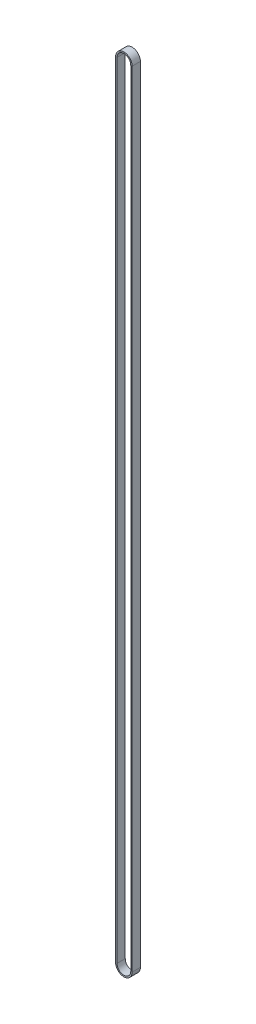
ISO-10303-21;
HEADER;
FILE_DESCRIPTION(('STEP AP214'),'2;1');
FILE_NAME('part.step','',(''),(''),'','','');
FILE_SCHEMA(('AUTOMOTIVE_DESIGN { 1 0 10303 214 1 1 1 1 }'));
ENDSEC;
DATA;
#1=APPLICATION_CONTEXT('core data for automotive mechanical design processes');
#2=APPLICATION_PROTOCOL_DEFINITION('international standard','automotive_design',2000,#1);
#3=PRODUCT_CONTEXT('',#1,'mechanical');
#4=PRODUCT('Part','Part','',(#3));
#5=PRODUCT_RELATED_PRODUCT_CATEGORY('part','',(#4));
#6=PRODUCT_DEFINITION_FORMATION('','',#4);
#7=PRODUCT_DEFINITION_CONTEXT('part definition',#1,'design');
#8=PRODUCT_DEFINITION('design','',#6,#7);
#9=PRODUCT_DEFINITION_SHAPE('','',#8);
#10=(LENGTH_UNIT() NAMED_UNIT(*) SI_UNIT(.MILLI.,.METRE.));
#11=(NAMED_UNIT(*) PLANE_ANGLE_UNIT() SI_UNIT($,.RADIAN.));
#12=(NAMED_UNIT(*) SI_UNIT($,.STERADIAN.) SOLID_ANGLE_UNIT());
#13=UNCERTAINTY_MEASURE_WITH_UNIT(LENGTH_MEASURE(1.E-05),#10,'distance_accuracy_value','');
#14=(GEOMETRIC_REPRESENTATION_CONTEXT(3) GLOBAL_UNCERTAINTY_ASSIGNED_CONTEXT((#13)) GLOBAL_UNIT_ASSIGNED_CONTEXT((#10,
#11,#12)) REPRESENTATION_CONTEXT('',''));
#15=CARTESIAN_POINT('',(0.,0.,0.));
#16=DIRECTION('',(0.,0.,1.));
#17=DIRECTION('',(1.,0.,0.));
#18=AXIS2_PLACEMENT_3D('',#15,#16,#17);
#19=CARTESIAN_POINT('',(0.,569.99997537,6.));
#20=DIRECTION('',(0.,0.,1.));
#21=DIRECTION('',(1.,0.,0.));
#22=AXIS2_PLACEMENT_3D('',#19,#20,#21);
#23=PLANE('',#22);
#24=CARTESIAN_POINT('',(0.,569.99997537,6.));
#25=DIRECTION('',(0.,0.,1.));
#26=DIRECTION('',(1.,0.,0.));
#27=AXIS2_PLACEMENT_3D('',#24,#25,#26);
#28=CIRCLE('',#27,6.);
#29=CARTESIAN_POINT('',(5.99999999999993,569.99997537,6.));
#30=VERTEX_POINT('',#29);
#31=CARTESIAN_POINT('',(-6.00000000000007,569.99997537,6.));
#32=VERTEX_POINT('',#31);
#33=EDGE_CURVE('E139',#30,#32,#28,.T.);
#34=ORIENTED_EDGE('',*,*,#33,.T.);
#35=DIRECTION('',(0.,-1.,0.));
#36=VECTOR('',#35,1.);
#37=CARTESIAN_POINT('',(-6.00000000000007,569.99997537,6.));
#38=LINE('',#37,#36);
#39=CARTESIAN_POINT('',(-6.,0.,6.));
#40=VERTEX_POINT('',#39);
#41=EDGE_CURVE('E142',#32,#40,#38,.T.);
#42=ORIENTED_EDGE('',*,*,#41,.T.);
#43=CARTESIAN_POINT('',(0.,0.,6.));
#44=DIRECTION('',(0.,0.,1.));
#45=DIRECTION('',(1.,0.,0.));
#46=AXIS2_PLACEMENT_3D('',#43,#44,#45);
#47=CIRCLE('',#46,6.);
#48=CARTESIAN_POINT('',(6.,0.,6.));
#49=VERTEX_POINT('',#48);
#50=EDGE_CURVE('E145',#40,#49,#47,.T.);
#51=ORIENTED_EDGE('',*,*,#50,.T.);
#52=DIRECTION('',(0.,1.,0.));
#53=VECTOR('',#52,1.);
#54=CARTESIAN_POINT('',(6.,0.,6.));
#55=LINE('',#54,#53);
#56=EDGE_CURVE('E147',#49,#30,#55,.T.);
#57=ORIENTED_EDGE('',*,*,#56,.T.);
#58=EDGE_LOOP('',(#34,#42,#51,#57));
#59=FACE_BOUND('',#58,.T.);
#60=DIRECTION('',(0.,-1.,0.));
#61=VECTOR('',#60,1.);
#62=CARTESIAN_POINT('',(-5.00000000000007,569.99997537,6.));
#63=LINE('',#62,#61);
#64=CARTESIAN_POINT('',(-5.00000000000007,569.99997537,6.));
#65=VERTEX_POINT('',#64);
#66=CARTESIAN_POINT('',(-5.,0.,6.));
#67=VERTEX_POINT('',#66);
#68=EDGE_CURVE('E110',#65,#67,#63,.T.);
#69=ORIENTED_EDGE('',*,*,#68,.F.);
#70=CARTESIAN_POINT('',(0.,569.99997537,6.));
#71=DIRECTION('',(0.,0.,1.));
#72=DIRECTION('',(1.,0.,0.));
#73=AXIS2_PLACEMENT_3D('',#70,#71,#72);
#74=CIRCLE('',#73,5.);
#75=CARTESIAN_POINT('',(4.99999999999993,569.99997537,6.));
#76=VERTEX_POINT('',#75);
#77=EDGE_CURVE('E102',#76,#65,#74,.T.);
#78=ORIENTED_EDGE('',*,*,#77,.F.);
#79=DIRECTION('',(0.,1.,0.));
#80=VECTOR('',#79,1.);
#81=CARTESIAN_POINT('',(5.,0.,6.));
#82=LINE('',#81,#80);
#83=CARTESIAN_POINT('',(5.,0.,6.));
#84=VERTEX_POINT('',#83);
#85=EDGE_CURVE('E124',#84,#76,#82,.T.);
#86=ORIENTED_EDGE('',*,*,#85,.F.);
#87=CARTESIAN_POINT('',(0.,0.,6.));
#88=DIRECTION('',(0.,0.,1.));
#89=DIRECTION('',(1.,0.,0.));
#90=AXIS2_PLACEMENT_3D('',#87,#88,#89);
#91=CIRCLE('',#90,5.);
#92=EDGE_CURVE('E122',#67,#84,#91,.T.);
#93=ORIENTED_EDGE('',*,*,#92,.F.);
#94=EDGE_LOOP('',(#69,#78,#86,#93));
#95=FACE_BOUND('',#94,.T.);
#96=ADVANCED_FACE('F37',(#59,#95),#23,.T.);
#97=CARTESIAN_POINT('',(0.,569.99997537,0.));
#98=DIRECTION('',(0.,0.,1.));
#99=DIRECTION('',(1.,0.,0.));
#100=AXIS2_PLACEMENT_3D('',#97,#98,#99);
#101=PLANE('',#100);
#102=CARTESIAN_POINT('',(0.,569.99997537,0.));
#103=DIRECTION('',(0.,0.,1.));
#104=DIRECTION('',(1.,0.,0.));
#105=AXIS2_PLACEMENT_3D('',#102,#103,#104);
#106=CIRCLE('',#105,6.);
#107=CARTESIAN_POINT('',(5.99999999999993,569.99997537,0.));
#108=VERTEX_POINT('',#107);
#109=CARTESIAN_POINT('',(-6.00000000000007,569.99997537,0.));
#110=VERTEX_POINT('',#109);
#111=EDGE_CURVE('E118',#108,#110,#106,.T.);
#112=ORIENTED_EDGE('',*,*,#111,.F.);
#113=DIRECTION('',(0.,1.,0.));
#114=VECTOR('',#113,1.);
#115=CARTESIAN_POINT('',(6.,0.,0.));
#116=LINE('',#115,#114);
#117=CARTESIAN_POINT('',(6.,0.,0.));
#118=VERTEX_POINT('',#117);
#119=EDGE_CURVE('E143',#118,#108,#116,.T.);
#120=ORIENTED_EDGE('',*,*,#119,.F.);
#121=CARTESIAN_POINT('',(0.,0.,0.));
#122=DIRECTION('',(0.,0.,1.));
#123=DIRECTION('',(1.,0.,0.));
#124=AXIS2_PLACEMENT_3D('',#121,#122,#123);
#125=CIRCLE('',#124,6.);
#126=CARTESIAN_POINT('',(-6.,0.,0.));
#127=VERTEX_POINT('',#126);
#128=EDGE_CURVE('E155',#127,#118,#125,.T.);
#129=ORIENTED_EDGE('',*,*,#128,.F.);
#130=DIRECTION('',(0.,-1.,0.));
#131=VECTOR('',#130,1.);
#132=CARTESIAN_POINT('',(-6.00000000000007,569.99997537,0.));
#133=LINE('',#132,#131);
#134=EDGE_CURVE('E153',#110,#127,#133,.T.);
#135=ORIENTED_EDGE('',*,*,#134,.F.);
#136=EDGE_LOOP('',(#112,#120,#129,#135));
#137=FACE_BOUND('',#136,.T.);
#138=CARTESIAN_POINT('',(0.,569.99997537,0.));
#139=DIRECTION('',(0.,0.,1.));
#140=DIRECTION('',(1.,0.,0.));
#141=AXIS2_PLACEMENT_3D('',#138,#139,#140);
#142=CIRCLE('',#141,5.);
#143=CARTESIAN_POINT('',(4.99999999999993,569.99997537,0.));
#144=VERTEX_POINT('',#143);
#145=CARTESIAN_POINT('',(-5.00000000000007,569.99997537,0.));
#146=VERTEX_POINT('',#145);
#147=EDGE_CURVE('E60',#144,#146,#142,.T.);
#148=ORIENTED_EDGE('',*,*,#147,.T.);
#149=DIRECTION('',(0.,-1.,0.));
#150=VECTOR('',#149,1.);
#151=CARTESIAN_POINT('',(-5.00000000000007,569.99997537,0.));
#152=LINE('',#151,#150);
#153=CARTESIAN_POINT('',(-5.,0.,0.));
#154=VERTEX_POINT('',#153);
#155=EDGE_CURVE('E117',#146,#154,#152,.T.);
#156=ORIENTED_EDGE('',*,*,#155,.T.);
#157=CARTESIAN_POINT('',(0.,0.,0.));
#158=DIRECTION('',(0.,0.,1.));
#159=DIRECTION('',(1.,0.,0.));
#160=AXIS2_PLACEMENT_3D('',#157,#158,#159);
#161=CIRCLE('',#160,5.);
#162=CARTESIAN_POINT('',(5.,0.,0.));
#163=VERTEX_POINT('',#162);
#164=EDGE_CURVE('E131',#154,#163,#161,.T.);
#165=ORIENTED_EDGE('',*,*,#164,.T.);
#166=DIRECTION('',(0.,1.,0.));
#167=VECTOR('',#166,1.);
#168=CARTESIAN_POINT('',(5.,0.,0.));
#169=LINE('',#168,#167);
#170=EDGE_CURVE('E111',#163,#144,#169,.T.);
#171=ORIENTED_EDGE('',*,*,#170,.T.);
#172=EDGE_LOOP('',(#148,#156,#165,#171));
#173=FACE_BOUND('',#172,.T.);
#174=ADVANCED_FACE('F174',(#137,#173),#101,.F.);
#175=CARTESIAN_POINT('',(0.,569.99997537,6.));
#176=DIRECTION('',(0.,0.,-1.));
#177=DIRECTION('',(-1.,0.,0.));
#178=AXIS2_PLACEMENT_3D('',#175,#176,#177);
#179=CYLINDRICAL_SURFACE('',#178,6.);
#180=ORIENTED_EDGE('',*,*,#111,.T.);
#181=DIRECTION('',(0.,0.,-1.));
#182=VECTOR('',#181,1.);
#183=CARTESIAN_POINT('',(-6.00000000000007,569.99997537,6.));
#184=LINE('',#183,#182);
#185=EDGE_CURVE('E11',#32,#110,#184,.T.);
#186=ORIENTED_EDGE('',*,*,#185,.F.);
#187=ORIENTED_EDGE('',*,*,#33,.F.);
#188=DIRECTION('',(0.,0.,-1.));
#189=VECTOR('',#188,1.);
#190=CARTESIAN_POINT('',(5.99999999999993,569.99997537,6.));
#191=LINE('',#190,#189);
#192=EDGE_CURVE('E150',#30,#108,#191,.T.);
#193=ORIENTED_EDGE('',*,*,#192,.T.);
#194=EDGE_LOOP('',(#180,#186,#187,#193));
#195=FACE_BOUND('',#194,.T.);
#196=ADVANCED_FACE('F39',(#195),#179,.T.);
#197=CARTESIAN_POINT('',(-6.00000000000007,569.99997537,6.));
#198=DIRECTION('',(1.,0.,0.));
#199=DIRECTION('',(0.,1.,0.));
#200=AXIS2_PLACEMENT_3D('',#197,#198,#199);
#201=PLANE('',#200);
#202=ORIENTED_EDGE('',*,*,#134,.T.);
#203=DIRECTION('',(0.,0.,-1.));
#204=VECTOR('',#203,1.);
#205=CARTESIAN_POINT('',(-6.,0.,6.));
#206=LINE('',#205,#204);
#207=EDGE_CURVE('E45',#40,#127,#206,.T.);
#208=ORIENTED_EDGE('',*,*,#207,.F.);
#209=ORIENTED_EDGE('',*,*,#41,.F.);
#210=ORIENTED_EDGE('',*,*,#185,.T.);
#211=EDGE_LOOP('',(#202,#208,#209,#210));
#212=FACE_BOUND('',#211,.T.);
#213=ADVANCED_FACE('F184',(#212),#201,.F.);
#214=CARTESIAN_POINT('',(0.,0.,6.));
#215=DIRECTION('',(0.,0.,-1.));
#216=DIRECTION('',(-1.,0.,0.));
#217=AXIS2_PLACEMENT_3D('',#214,#215,#216);
#218=CYLINDRICAL_SURFACE('',#217,6.);
#219=ORIENTED_EDGE('',*,*,#128,.T.);
#220=DIRECTION('',(0.,0.,-1.));
#221=VECTOR('',#220,1.);
#222=CARTESIAN_POINT('',(6.,0.,6.));
#223=LINE('',#222,#221);
#224=EDGE_CURVE('E161',#49,#118,#223,.T.);
#225=ORIENTED_EDGE('',*,*,#224,.F.);
#226=ORIENTED_EDGE('',*,*,#50,.F.);
#227=ORIENTED_EDGE('',*,*,#207,.T.);
#228=EDGE_LOOP('',(#219,#225,#226,#227));
#229=FACE_BOUND('',#228,.T.);
#230=ADVANCED_FACE('F168',(#229),#218,.T.);
#231=CARTESIAN_POINT('',(6.,0.,6.));
#232=DIRECTION('',(-1.,0.,0.));
#233=DIRECTION('',(0.,-1.,0.));
#234=AXIS2_PLACEMENT_3D('',#231,#232,#233);
#235=PLANE('',#234);
#236=ORIENTED_EDGE('',*,*,#119,.T.);
#237=ORIENTED_EDGE('',*,*,#192,.F.);
#238=ORIENTED_EDGE('',*,*,#56,.F.);
#239=ORIENTED_EDGE('',*,*,#224,.T.);
#240=EDGE_LOOP('',(#236,#237,#238,#239));
#241=FACE_BOUND('',#240,.T.);
#242=ADVANCED_FACE('F178',(#241),#235,.F.);
#243=CARTESIAN_POINT('',(0.,569.99997537,6.));
#244=DIRECTION('',(0.,0.,-1.));
#245=DIRECTION('',(-1.,0.,0.));
#246=AXIS2_PLACEMENT_3D('',#243,#244,#245);
#247=CYLINDRICAL_SURFACE('',#246,5.);
#248=ORIENTED_EDGE('',*,*,#147,.F.);
#249=DIRECTION('',(0.,0.,-1.));
#250=VECTOR('',#249,1.);
#251=CARTESIAN_POINT('',(4.99999999999993,569.99997537,6.));
#252=LINE('',#251,#250);
#253=EDGE_CURVE('E106',#76,#144,#252,.T.);
#254=ORIENTED_EDGE('',*,*,#253,.F.);
#255=ORIENTED_EDGE('',*,*,#77,.T.);
#256=DIRECTION('',(0.,0.,-1.));
#257=VECTOR('',#256,1.);
#258=CARTESIAN_POINT('',(-5.00000000000007,569.99997537,6.));
#259=LINE('',#258,#257);
#260=EDGE_CURVE('E105',#65,#146,#259,.T.);
#261=ORIENTED_EDGE('',*,*,#260,.T.);
#262=EDGE_LOOP('',(#248,#254,#255,#261));
#263=FACE_BOUND('',#262,.T.);
#264=ADVANCED_FACE('F104',(#263),#247,.F.);
#265=CARTESIAN_POINT('',(-5.00000000000007,569.99997537,6.));
#266=DIRECTION('',(1.,0.,0.));
#267=DIRECTION('',(0.,1.,0.));
#268=AXIS2_PLACEMENT_3D('',#265,#266,#267);
#269=PLANE('',#268);
#270=ORIENTED_EDGE('',*,*,#155,.F.);
#271=ORIENTED_EDGE('',*,*,#260,.F.);
#272=ORIENTED_EDGE('',*,*,#68,.T.);
#273=DIRECTION('',(0.,0.,-1.));
#274=VECTOR('',#273,1.);
#275=CARTESIAN_POINT('',(-5.,0.,6.));
#276=LINE('',#275,#274);
#277=EDGE_CURVE('E119',#67,#154,#276,.T.);
#278=ORIENTED_EDGE('',*,*,#277,.T.);
#279=EDGE_LOOP('',(#270,#271,#272,#278));
#280=FACE_BOUND('',#279,.T.);
#281=ADVANCED_FACE('F114',(#280),#269,.T.);
#282=CARTESIAN_POINT('',(0.,0.,6.));
#283=DIRECTION('',(0.,0.,-1.));
#284=DIRECTION('',(-1.,0.,0.));
#285=AXIS2_PLACEMENT_3D('',#282,#283,#284);
#286=CYLINDRICAL_SURFACE('',#285,5.);
#287=ORIENTED_EDGE('',*,*,#164,.F.);
#288=ORIENTED_EDGE('',*,*,#277,.F.);
#289=ORIENTED_EDGE('',*,*,#92,.T.);
#290=DIRECTION('',(0.,0.,-1.));
#291=VECTOR('',#290,1.);
#292=CARTESIAN_POINT('',(5.,0.,6.));
#293=LINE('',#292,#291);
#294=EDGE_CURVE('E52',#84,#163,#293,.T.);
#295=ORIENTED_EDGE('',*,*,#294,.T.);
#296=EDGE_LOOP('',(#287,#288,#289,#295));
#297=FACE_BOUND('',#296,.T.);
#298=ADVANCED_FACE('F207',(#297),#286,.F.);
#299=CARTESIAN_POINT('',(5.,0.,6.));
#300=DIRECTION('',(-1.,0.,0.));
#301=DIRECTION('',(0.,-1.,0.));
#302=AXIS2_PLACEMENT_3D('',#299,#300,#301);
#303=PLANE('',#302);
#304=ORIENTED_EDGE('',*,*,#170,.F.);
#305=ORIENTED_EDGE('',*,*,#294,.F.);
#306=ORIENTED_EDGE('',*,*,#85,.T.);
#307=ORIENTED_EDGE('',*,*,#253,.T.);
#308=EDGE_LOOP('',(#304,#305,#306,#307));
#309=FACE_BOUND('',#308,.T.);
#310=ADVANCED_FACE('F211',(#309),#303,.T.);
#311=CLOSED_SHELL('',(#96,#174,#196,#213,#230,#242,#264,#281,#298,#310));
#312=MANIFOLD_SOLID_BREP('B2',#311);
#313=ADVANCED_BREP_SHAPE_REPRESENTATION('',(#18,#312),#14);
#314=SHAPE_DEFINITION_REPRESENTATION(#9,#313);
ENDSEC;
END-ISO-10303-21;
